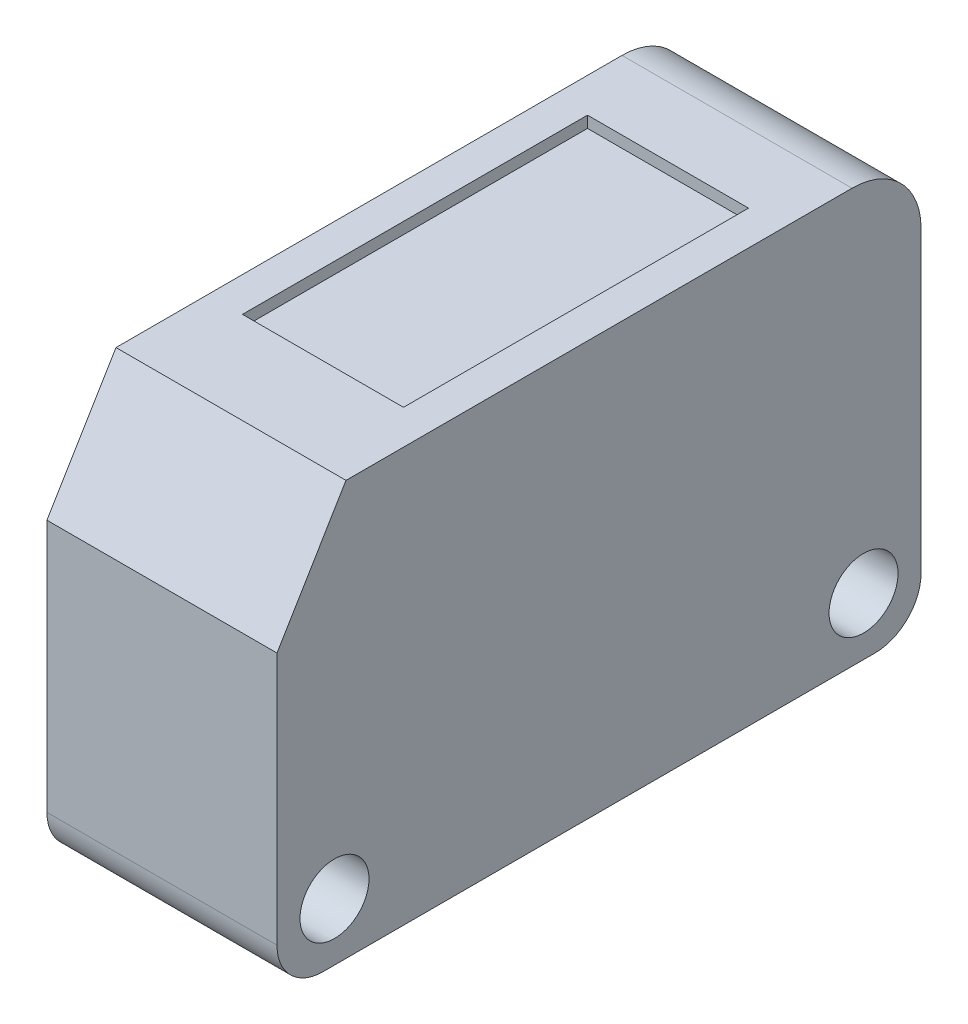
ISO-10303-21;
HEADER;
FILE_DESCRIPTION(('STEP AP214'),'2;1');
FILE_NAME('part.step','',(''),(''),'','','');
FILE_SCHEMA(('AUTOMOTIVE_DESIGN { 1 0 10303 214 1 1 1 1 }'));
ENDSEC;
DATA;
#1=APPLICATION_CONTEXT('core data for automotive mechanical design processes');
#2=APPLICATION_PROTOCOL_DEFINITION('international standard','automotive_design',2000,#1);
#3=PRODUCT_CONTEXT('',#1,'mechanical');
#4=PRODUCT('Part','Part','',(#3));
#5=PRODUCT_RELATED_PRODUCT_CATEGORY('part','',(#4));
#6=PRODUCT_DEFINITION_FORMATION('','',#4);
#7=PRODUCT_DEFINITION_CONTEXT('part definition',#1,'design');
#8=PRODUCT_DEFINITION('design','',#6,#7);
#9=PRODUCT_DEFINITION_SHAPE('','',#8);
#10=(LENGTH_UNIT() NAMED_UNIT(*) SI_UNIT(.MILLI.,.METRE.));
#11=(NAMED_UNIT(*) PLANE_ANGLE_UNIT() SI_UNIT($,.RADIAN.));
#12=(NAMED_UNIT(*) SI_UNIT($,.STERADIAN.) SOLID_ANGLE_UNIT());
#13=UNCERTAINTY_MEASURE_WITH_UNIT(LENGTH_MEASURE(1.E-05),#10,'distance_accuracy_value','');
#14=(GEOMETRIC_REPRESENTATION_CONTEXT(3) GLOBAL_UNCERTAINTY_ASSIGNED_CONTEXT((#13)) GLOBAL_UNIT_ASSIGNED_CONTEXT((#10,
#11,#12)) REPRESENTATION_CONTEXT('',''));
#15=CARTESIAN_POINT('',(0.,0.,0.));
#16=DIRECTION('',(0.,0.,1.));
#17=DIRECTION('',(1.,0.,0.));
#18=AXIS2_PLACEMENT_3D('',#15,#16,#17);
#19=CARTESIAN_POINT('',(5.,15.,3.));
#20=DIRECTION('',(1.,0.,0.));
#21=DIRECTION('',(0.,0.,-1.));
#22=AXIS2_PLACEMENT_3D('',#19,#20,#21);
#23=CYLINDRICAL_SURFACE('',#22,3.);
#24=CARTESIAN_POINT('',(10.,15.,3.));
#25=DIRECTION('',(1.,0.,0.));
#26=DIRECTION('',(0.,0.,-1.));
#27=AXIS2_PLACEMENT_3D('',#24,#25,#26);
#28=CIRCLE('',#27,3.);
#29=CARTESIAN_POINT('',(10.,15.,0.));
#30=VERTEX_POINT('',#29);
#31=CARTESIAN_POINT('',(10.,18.,3.));
#32=VERTEX_POINT('',#31);
#33=EDGE_CURVE('E10',#30,#32,#28,.T.);
#34=ORIENTED_EDGE('',*,*,#33,.F.);
#35=DIRECTION('',(1.,0.,0.));
#36=VECTOR('',#35,1.);
#37=CARTESIAN_POINT('',(5.,15.,0.));
#38=LINE('',#37,#36);
#39=CARTESIAN_POINT('',(0.,15.,0.));
#40=VERTEX_POINT('',#39);
#41=EDGE_CURVE('E26',#40,#30,#38,.T.);
#42=ORIENTED_EDGE('',*,*,#41,.F.);
#43=CARTESIAN_POINT('',(0.,15.,3.));
#44=DIRECTION('',(1.,0.,0.));
#45=DIRECTION('',(0.,0.,-1.));
#46=AXIS2_PLACEMENT_3D('',#43,#44,#45);
#47=CIRCLE('',#46,3.);
#48=CARTESIAN_POINT('',(0.,18.,3.));
#49=VERTEX_POINT('',#48);
#50=EDGE_CURVE('E146',#40,#49,#47,.T.);
#51=ORIENTED_EDGE('',*,*,#50,.T.);
#52=DIRECTION('',(1.,0.,0.));
#53=VECTOR('',#52,1.);
#54=CARTESIAN_POINT('',(5.,18.,3.));
#55=LINE('',#54,#53);
#56=EDGE_CURVE('E35',#49,#32,#55,.T.);
#57=ORIENTED_EDGE('',*,*,#56,.T.);
#58=EDGE_LOOP('',(#34,#42,#51,#57));
#59=FACE_BOUND('',#58,.T.);
#60=ADVANCED_FACE('F15',(#59),#23,.T.);
#61=CARTESIAN_POINT('',(0.,13.,28.));
#62=DIRECTION('',(0.,-0.514495755427526,-0.857492925712545));
#63=DIRECTION('',(0.,0.857492925712545,-0.514495755427526));
#64=AXIS2_PLACEMENT_3D('',#61,#62,#63);
#65=PLANE('',#64);
#66=DIRECTION('',(0.,-0.857492925712545,0.514495755427526));
#67=VECTOR('',#66,1.);
#68=CARTESIAN_POINT('',(10.,15.5,26.5));
#69=LINE('',#68,#67);
#70=CARTESIAN_POINT('',(10.,18.,25.));
#71=VERTEX_POINT('',#70);
#72=CARTESIAN_POINT('',(10.,13.,28.));
#73=VERTEX_POINT('',#72);
#74=EDGE_CURVE('E235',#71,#73,#69,.T.);
#75=ORIENTED_EDGE('',*,*,#74,.F.);
#76=DIRECTION('',(1.,0.,0.));
#77=VECTOR('',#76,1.);
#78=CARTESIAN_POINT('',(5.,18.,25.));
#79=LINE('',#78,#77);
#80=CARTESIAN_POINT('',(0.,18.,25.));
#81=VERTEX_POINT('',#80);
#82=EDGE_CURVE('E232',#81,#71,#79,.T.);
#83=ORIENTED_EDGE('',*,*,#82,.F.);
#84=DIRECTION('',(0.,-0.857492925712545,0.514495755427526));
#85=VECTOR('',#84,1.);
#86=CARTESIAN_POINT('',(0.,15.5,26.5));
#87=LINE('',#86,#85);
#88=CARTESIAN_POINT('',(0.,13.,28.));
#89=VERTEX_POINT('',#88);
#90=EDGE_CURVE('E164',#81,#89,#87,.T.);
#91=ORIENTED_EDGE('',*,*,#90,.T.);
#92=DIRECTION('',(1.,0.,0.));
#93=VECTOR('',#92,1.);
#94=CARTESIAN_POINT('',(5.,13.,28.));
#95=LINE('',#94,#93);
#96=EDGE_CURVE('E161',#89,#73,#95,.T.);
#97=ORIENTED_EDGE('',*,*,#96,.T.);
#98=EDGE_LOOP('',(#75,#83,#91,#97));
#99=FACE_BOUND('',#98,.T.);
#100=ADVANCED_FACE('F270',(#99),#65,.F.);
#101=CARTESIAN_POINT('',(0.,18.,3.));
#102=DIRECTION('',(0.,1.,0.));
#103=DIRECTION('',(0.,0.,1.));
#104=AXIS2_PLACEMENT_3D('',#101,#102,#103);
#105=PLANE('',#104);
#106=DIRECTION('',(0.,0.,1.));
#107=VECTOR('',#106,1.);
#108=CARTESIAN_POINT('',(10.,18.,14.));
#109=LINE('',#108,#107);
#110=EDGE_CURVE('E228',#32,#71,#109,.T.);
#111=ORIENTED_EDGE('',*,*,#110,.F.);
#112=ORIENTED_EDGE('',*,*,#56,.F.);
#113=DIRECTION('',(0.,0.,1.));
#114=VECTOR('',#113,1.);
#115=CARTESIAN_POINT('',(0.,18.,14.));
#116=LINE('',#115,#114);
#117=EDGE_CURVE('E224',#49,#81,#116,.T.);
#118=ORIENTED_EDGE('',*,*,#117,.T.);
#119=ORIENTED_EDGE('',*,*,#82,.T.);
#120=EDGE_LOOP('',(#111,#112,#118,#119));
#121=FACE_BOUND('',#120,.T.);
#122=DIRECTION('',(1.,0.,0.));
#123=VECTOR('',#122,1.);
#124=CARTESIAN_POINT('',(5.,18.,21.));
#125=LINE('',#124,#123);
#126=CARTESIAN_POINT('',(1.5,18.,21.));
#127=VERTEX_POINT('',#126);
#128=CARTESIAN_POINT('',(8.5,18.,21.));
#129=VERTEX_POINT('',#128);
#130=EDGE_CURVE('E220',#127,#129,#125,.T.);
#131=ORIENTED_EDGE('',*,*,#130,.F.);
#132=DIRECTION('',(0.,0.,1.));
#133=VECTOR('',#132,1.);
#134=CARTESIAN_POINT('',(1.5,18.,13.5));
#135=LINE('',#134,#133);
#136=CARTESIAN_POINT('',(1.5,18.,6.));
#137=VERTEX_POINT('',#136);
#138=EDGE_CURVE('E209',#137,#127,#135,.T.);
#139=ORIENTED_EDGE('',*,*,#138,.F.);
#140=DIRECTION('',(-1.,0.,0.));
#141=VECTOR('',#140,1.);
#142=CARTESIAN_POINT('',(5.,18.,6.));
#143=LINE('',#142,#141);
#144=CARTESIAN_POINT('',(8.5,18.,6.));
#145=VERTEX_POINT('',#144);
#146=EDGE_CURVE('E212',#145,#137,#143,.T.);
#147=ORIENTED_EDGE('',*,*,#146,.F.);
#148=DIRECTION('',(0.,0.,-1.));
#149=VECTOR('',#148,1.);
#150=CARTESIAN_POINT('',(8.5,18.,13.5));
#151=LINE('',#150,#149);
#152=EDGE_CURVE('E216',#129,#145,#151,.T.);
#153=ORIENTED_EDGE('',*,*,#152,.F.);
#154=EDGE_LOOP('',(#131,#139,#147,#153));
#155=FACE_BOUND('',#154,.T.);
#156=ADVANCED_FACE('F265',(#121,#155),#105,.T.);
#157=CARTESIAN_POINT('',(8.5,18.,21.));
#158=DIRECTION('',(-1.,0.,0.));
#159=DIRECTION('',(0.,0.,1.));
#160=AXIS2_PLACEMENT_3D('',#157,#158,#159);
#161=PLANE('',#160);
#162=DIRECTION('',(0.,0.,-1.));
#163=VECTOR('',#162,1.);
#164=CARTESIAN_POINT('',(8.5,17.5,13.5));
#165=LINE('',#164,#163);
#166=CARTESIAN_POINT('',(8.5,17.5,21.));
#167=VERTEX_POINT('',#166);
#168=CARTESIAN_POINT('',(8.5,17.5,5.99999999999999));
#169=VERTEX_POINT('',#168);
#170=EDGE_CURVE('E203',#167,#169,#165,.T.);
#171=ORIENTED_EDGE('',*,*,#170,.F.);
#172=DIRECTION('',(0.,-1.,0.));
#173=VECTOR('',#172,1.);
#174=CARTESIAN_POINT('',(8.5,17.75,21.));
#175=LINE('',#174,#173);
#176=EDGE_CURVE('E200',#129,#167,#175,.T.);
#177=ORIENTED_EDGE('',*,*,#176,.F.);
#178=ORIENTED_EDGE('',*,*,#152,.T.);
#179=DIRECTION('',(0.,-1.,0.));
#180=VECTOR('',#179,1.);
#181=CARTESIAN_POINT('',(8.5,17.75,5.99999999999999));
#182=LINE('',#181,#180);
#183=EDGE_CURVE('E186',#145,#169,#182,.T.);
#184=ORIENTED_EDGE('',*,*,#183,.T.);
#185=EDGE_LOOP('',(#171,#177,#178,#184));
#186=FACE_BOUND('',#185,.T.);
#187=ADVANCED_FACE('F298',(#186),#161,.T.);
#188=CARTESIAN_POINT('',(8.5,18.,21.));
#189=DIRECTION('',(0.,0.,1.));
#190=DIRECTION('',(1.,0.,0.));
#191=AXIS2_PLACEMENT_3D('',#188,#189,#190);
#192=PLANE('',#191);
#193=DIRECTION('',(1.,0.,0.));
#194=VECTOR('',#193,1.);
#195=CARTESIAN_POINT('',(5.,17.5,21.));
#196=LINE('',#195,#194);
#197=CARTESIAN_POINT('',(1.5,17.5,21.));
#198=VERTEX_POINT('',#197);
#199=EDGE_CURVE('E196',#198,#167,#196,.T.);
#200=ORIENTED_EDGE('',*,*,#199,.F.);
#201=DIRECTION('',(0.,-1.,0.));
#202=VECTOR('',#201,1.);
#203=CARTESIAN_POINT('',(1.5,17.75,21.));
#204=LINE('',#203,#202);
#205=EDGE_CURVE('E193',#127,#198,#204,.T.);
#206=ORIENTED_EDGE('',*,*,#205,.F.);
#207=ORIENTED_EDGE('',*,*,#130,.T.);
#208=ORIENTED_EDGE('',*,*,#176,.T.);
#209=EDGE_LOOP('',(#200,#206,#207,#208));
#210=FACE_BOUND('',#209,.T.);
#211=ADVANCED_FACE('F301',(#210),#192,.F.);
#212=CARTESIAN_POINT('',(1.5,18.,6.));
#213=DIRECTION('',(0.,0.,-1.));
#214=DIRECTION('',(-1.,0.,0.));
#215=AXIS2_PLACEMENT_3D('',#212,#213,#214);
#216=PLANE('',#215);
#217=DIRECTION('',(-1.,0.,0.));
#218=VECTOR('',#217,1.);
#219=CARTESIAN_POINT('',(5.,17.5,6.));
#220=LINE('',#219,#218);
#221=CARTESIAN_POINT('',(1.5,17.5,6.));
#222=VERTEX_POINT('',#221);
#223=EDGE_CURVE('E189',#169,#222,#220,.T.);
#224=ORIENTED_EDGE('',*,*,#223,.F.);
#225=ORIENTED_EDGE('',*,*,#183,.F.);
#226=ORIENTED_EDGE('',*,*,#146,.T.);
#227=DIRECTION('',(0.,-1.,0.));
#228=VECTOR('',#227,1.);
#229=CARTESIAN_POINT('',(1.5,17.75,6.));
#230=LINE('',#229,#228);
#231=EDGE_CURVE('E181',#137,#222,#230,.T.);
#232=ORIENTED_EDGE('',*,*,#231,.T.);
#233=EDGE_LOOP('',(#224,#225,#226,#232));
#234=FACE_BOUND('',#233,.T.);
#235=ADVANCED_FACE('F305',(#234),#216,.F.);
#236=CARTESIAN_POINT('',(0.,17.5,0.));
#237=DIRECTION('',(0.,1.,0.));
#238=DIRECTION('',(0.,0.,1.));
#239=AXIS2_PLACEMENT_3D('',#236,#237,#238);
#240=PLANE('',#239);
#241=ORIENTED_EDGE('',*,*,#199,.T.);
#242=ORIENTED_EDGE('',*,*,#170,.T.);
#243=ORIENTED_EDGE('',*,*,#223,.T.);
#244=DIRECTION('',(0.,0.,1.));
#245=VECTOR('',#244,1.);
#246=CARTESIAN_POINT('',(1.5,17.5,13.5));
#247=LINE('',#246,#245);
#248=EDGE_CURVE('E182',#222,#198,#247,.T.);
#249=ORIENTED_EDGE('',*,*,#248,.T.);
#250=EDGE_LOOP('',(#241,#242,#243,#249));
#251=FACE_BOUND('',#250,.T.);
#252=ADVANCED_FACE('F309',(#251),#240,.T.);
#253=CARTESIAN_POINT('',(1.5,18.,6.));
#254=DIRECTION('',(1.,0.,0.));
#255=DIRECTION('',(0.,0.,-1.));
#256=AXIS2_PLACEMENT_3D('',#253,#254,#255);
#257=PLANE('',#256);
#258=ORIENTED_EDGE('',*,*,#248,.F.);
#259=ORIENTED_EDGE('',*,*,#231,.F.);
#260=ORIENTED_EDGE('',*,*,#138,.T.);
#261=ORIENTED_EDGE('',*,*,#205,.T.);
#262=EDGE_LOOP('',(#258,#259,#260,#261));
#263=FACE_BOUND('',#262,.T.);
#264=ADVANCED_FACE('F313',(#263),#257,.T.);
#265=CARTESIAN_POINT('',(5.,2.5,2.5));
#266=DIRECTION('',(1.,0.,0.));
#267=DIRECTION('',(0.,0.,-1.));
#268=AXIS2_PLACEMENT_3D('',#265,#266,#267);
#269=CYLINDRICAL_SURFACE('',#268,1.5);
#270=CARTESIAN_POINT('',(0.,2.5,2.5));
#271=DIRECTION('',(1.,0.,0.));
#272=DIRECTION('',(0.,0.,-1.));
#273=AXIS2_PLACEMENT_3D('',#270,#271,#272);
#274=CIRCLE('',#273,1.5);
#275=CARTESIAN_POINT('',(0.,2.5,1.));
#276=VERTEX_POINT('',#275);
#277=EDGE_CURVE('E174',#276,#276,#274,.T.);
#278=ORIENTED_EDGE('',*,*,#277,.F.);
#279=EDGE_LOOP('',(#278));
#280=FACE_BOUND('',#279,.T.);
#281=CARTESIAN_POINT('',(10.,2.5,2.5));
#282=DIRECTION('',(1.,0.,0.));
#283=DIRECTION('',(0.,0.,-1.));
#284=AXIS2_PLACEMENT_3D('',#281,#282,#283);
#285=CIRCLE('',#284,1.5);
#286=CARTESIAN_POINT('',(10.,2.5,1.));
#287=VERTEX_POINT('',#286);
#288=EDGE_CURVE('E145',#287,#287,#285,.T.);
#289=ORIENTED_EDGE('',*,*,#288,.T.);
#290=EDGE_LOOP('',(#289));
#291=FACE_BOUND('',#290,.T.);
#292=ADVANCED_FACE('F317',(#280,#291),#269,.F.);
#293=CARTESIAN_POINT('',(5.,2.5,25.5));
#294=DIRECTION('',(1.,0.,0.));
#295=DIRECTION('',(0.,0.,-1.));
#296=AXIS2_PLACEMENT_3D('',#293,#294,#295);
#297=CYLINDRICAL_SURFACE('',#296,1.5);
#298=CARTESIAN_POINT('',(0.,2.5,25.5));
#299=DIRECTION('',(1.,0.,0.));
#300=DIRECTION('',(0.,0.,-1.));
#301=AXIS2_PLACEMENT_3D('',#298,#299,#300);
#302=CIRCLE('',#301,1.5);
#303=CARTESIAN_POINT('',(0.,2.5,24.));
#304=VERTEX_POINT('',#303);
#305=EDGE_CURVE('E170',#304,#304,#302,.T.);
#306=ORIENTED_EDGE('',*,*,#305,.F.);
#307=EDGE_LOOP('',(#306));
#308=FACE_BOUND('',#307,.T.);
#309=CARTESIAN_POINT('',(10.,2.5,25.5));
#310=DIRECTION('',(1.,0.,0.));
#311=DIRECTION('',(0.,0.,-1.));
#312=AXIS2_PLACEMENT_3D('',#309,#310,#311);
#313=CIRCLE('',#312,1.5);
#314=CARTESIAN_POINT('',(10.,2.5,24.));
#315=VERTEX_POINT('',#314);
#316=EDGE_CURVE('E135',#315,#315,#313,.T.);
#317=ORIENTED_EDGE('',*,*,#316,.T.);
#318=EDGE_LOOP('',(#317));
#319=FACE_BOUND('',#318,.T.);
#320=ADVANCED_FACE('F287',(#308,#319),#297,.F.);
#321=CARTESIAN_POINT('',(0.,13.,28.));
#322=DIRECTION('',(0.,0.,1.));
#323=DIRECTION('',(1.,0.,0.));
#324=AXIS2_PLACEMENT_3D('',#321,#322,#323);
#325=PLANE('',#324);
#326=DIRECTION('',(1.,0.,0.));
#327=VECTOR('',#326,1.);
#328=CARTESIAN_POINT('',(5.,2.,28.));
#329=LINE('',#328,#327);
#330=CARTESIAN_POINT('',(0.,2.,28.));
#331=VERTEX_POINT('',#330);
#332=CARTESIAN_POINT('',(10.,2.,28.));
#333=VERTEX_POINT('',#332);
#334=EDGE_CURVE('E151',#331,#333,#329,.T.);
#335=ORIENTED_EDGE('',*,*,#334,.T.);
#336=DIRECTION('',(0.,-1.,0.));
#337=VECTOR('',#336,1.);
#338=CARTESIAN_POINT('',(10.,7.5,28.));
#339=LINE('',#338,#337);
#340=EDGE_CURVE('E158',#73,#333,#339,.T.);
#341=ORIENTED_EDGE('',*,*,#340,.F.);
#342=ORIENTED_EDGE('',*,*,#96,.F.);
#343=DIRECTION('',(0.,-1.,0.));
#344=VECTOR('',#343,1.);
#345=CARTESIAN_POINT('',(0.,7.5,28.));
#346=LINE('',#345,#344);
#347=EDGE_CURVE('E155',#89,#331,#346,.T.);
#348=ORIENTED_EDGE('',*,*,#347,.T.);
#349=EDGE_LOOP('',(#335,#341,#342,#348));
#350=FACE_BOUND('',#349,.T.);
#351=ADVANCED_FACE('F274',(#350),#325,.T.);
#352=CARTESIAN_POINT('',(5.,2.,26.));
#353=DIRECTION('',(1.,0.,0.));
#354=DIRECTION('',(0.,0.,-1.));
#355=AXIS2_PLACEMENT_3D('',#352,#353,#354);
#356=CYLINDRICAL_SURFACE('',#355,2.);
#357=DIRECTION('',(1.,0.,0.));
#358=VECTOR('',#357,1.);
#359=CARTESIAN_POINT('',(5.,0.,26.));
#360=LINE('',#359,#358);
#361=CARTESIAN_POINT('',(0.,0.,26.));
#362=VERTEX_POINT('',#361);
#363=CARTESIAN_POINT('',(10.,0.,26.));
#364=VERTEX_POINT('',#363);
#365=EDGE_CURVE('E126',#362,#364,#360,.T.);
#366=ORIENTED_EDGE('',*,*,#365,.T.);
#367=CARTESIAN_POINT('',(10.,2.,26.));
#368=DIRECTION('',(-1.,0.,0.));
#369=DIRECTION('',(0.,0.,-1.));
#370=AXIS2_PLACEMENT_3D('',#367,#368,#369);
#371=CIRCLE('',#370,2.);
#372=EDGE_CURVE('E123',#364,#333,#371,.T.);
#373=ORIENTED_EDGE('',*,*,#372,.T.);
#374=ORIENTED_EDGE('',*,*,#334,.F.);
#375=CARTESIAN_POINT('',(0.,2.,26.));
#376=DIRECTION('',(1.,0.,0.));
#377=DIRECTION('',(0.,0.,-1.));
#378=AXIS2_PLACEMENT_3D('',#375,#376,#377);
#379=CIRCLE('',#378,2.);
#380=EDGE_CURVE('E139',#331,#362,#379,.T.);
#381=ORIENTED_EDGE('',*,*,#380,.T.);
#382=EDGE_LOOP('',(#366,#373,#374,#381));
#383=FACE_BOUND('',#382,.T.);
#384=ADVANCED_FACE('F278',(#383),#356,.T.);
#385=CARTESIAN_POINT('',(0.,0.,0.));
#386=DIRECTION('',(0.,0.,-1.));
#387=DIRECTION('',(-1.,0.,0.));
#388=AXIS2_PLACEMENT_3D('',#385,#386,#387);
#389=PLANE('',#388);
#390=DIRECTION('',(1.,0.,0.));
#391=VECTOR('',#390,1.);
#392=CARTESIAN_POINT('',(5.,2.,0.));
#393=LINE('',#392,#391);
#394=CARTESIAN_POINT('',(0.,2.,0.));
#395=VERTEX_POINT('',#394);
#396=CARTESIAN_POINT('',(10.,2.,0.));
#397=VERTEX_POINT('',#396);
#398=EDGE_CURVE('E130',#395,#397,#393,.T.);
#399=ORIENTED_EDGE('',*,*,#398,.F.);
#400=DIRECTION('',(0.,1.,0.));
#401=VECTOR('',#400,1.);
#402=CARTESIAN_POINT('',(0.,8.5,0.));
#403=LINE('',#402,#401);
#404=EDGE_CURVE('E141',#395,#40,#403,.T.);
#405=ORIENTED_EDGE('',*,*,#404,.T.);
#406=ORIENTED_EDGE('',*,*,#41,.T.);
#407=DIRECTION('',(0.,1.,0.));
#408=VECTOR('',#407,1.);
#409=CARTESIAN_POINT('',(10.,8.5,0.));
#410=LINE('',#409,#408);
#411=EDGE_CURVE('E147',#397,#30,#410,.T.);
#412=ORIENTED_EDGE('',*,*,#411,.F.);
#413=EDGE_LOOP('',(#399,#405,#406,#412));
#414=FACE_BOUND('',#413,.T.);
#415=ADVANCED_FACE('F262',(#414),#389,.T.);
#416=CARTESIAN_POINT('',(0.,0.,28.));
#417=DIRECTION('',(0.,-1.,0.));
#418=DIRECTION('',(0.,0.,-1.));
#419=AXIS2_PLACEMENT_3D('',#416,#417,#418);
#420=PLANE('',#419);
#421=DIRECTION('',(1.,0.,0.));
#422=VECTOR('',#421,1.);
#423=CARTESIAN_POINT('',(5.,0.,2.));
#424=LINE('',#423,#422);
#425=CARTESIAN_POINT('',(0.,0.,2.));
#426=VERTEX_POINT('',#425);
#427=CARTESIAN_POINT('',(10.,0.,2.));
#428=VERTEX_POINT('',#427);
#429=EDGE_CURVE('E102',#426,#428,#424,.T.);
#430=ORIENTED_EDGE('',*,*,#429,.T.);
#431=DIRECTION('',(0.,0.,-1.));
#432=VECTOR('',#431,1.);
#433=CARTESIAN_POINT('',(10.,0.,14.));
#434=LINE('',#433,#432);
#435=EDGE_CURVE('E109',#364,#428,#434,.T.);
#436=ORIENTED_EDGE('',*,*,#435,.F.);
#437=ORIENTED_EDGE('',*,*,#365,.F.);
#438=DIRECTION('',(0.,0.,-1.));
#439=VECTOR('',#438,1.);
#440=CARTESIAN_POINT('',(0.,0.,14.));
#441=LINE('',#440,#439);
#442=EDGE_CURVE('E111',#362,#426,#441,.T.);
#443=ORIENTED_EDGE('',*,*,#442,.T.);
#444=EDGE_LOOP('',(#430,#436,#437,#443));
#445=FACE_BOUND('',#444,.T.);
#446=ADVANCED_FACE('F107',(#445),#420,.T.);
#447=CARTESIAN_POINT('',(10.,0.,0.));
#448=DIRECTION('',(1.,0.,0.));
#449=DIRECTION('',(0.,0.,-1.));
#450=AXIS2_PLACEMENT_3D('',#447,#448,#449);
#451=PLANE('',#450);
#452=CARTESIAN_POINT('',(10.,2.,2.));
#453=DIRECTION('',(-1.,0.,0.));
#454=DIRECTION('',(0.,0.,-1.));
#455=AXIS2_PLACEMENT_3D('',#452,#453,#454);
#456=CIRCLE('',#455,2.);
#457=EDGE_CURVE('E120',#397,#428,#456,.T.);
#458=ORIENTED_EDGE('',*,*,#457,.F.);
#459=ORIENTED_EDGE('',*,*,#411,.T.);
#460=ORIENTED_EDGE('',*,*,#33,.T.);
#461=ORIENTED_EDGE('',*,*,#110,.T.);
#462=ORIENTED_EDGE('',*,*,#74,.T.);
#463=ORIENTED_EDGE('',*,*,#340,.T.);
#464=ORIENTED_EDGE('',*,*,#372,.F.);
#465=ORIENTED_EDGE('',*,*,#435,.T.);
#466=EDGE_LOOP('',(#458,#459,#460,#461,#462,#463,#464,#465));
#467=FACE_BOUND('',#466,.T.);
#468=ORIENTED_EDGE('',*,*,#316,.F.);
#469=EDGE_LOOP('',(#468));
#470=FACE_BOUND('',#469,.T.);
#471=ORIENTED_EDGE('',*,*,#288,.F.);
#472=EDGE_LOOP('',(#471));
#473=FACE_BOUND('',#472,.T.);
#474=ADVANCED_FACE('F117',(#467,#470,#473),#451,.T.);
#475=CARTESIAN_POINT('',(0.,0.,0.));
#476=DIRECTION('',(1.,0.,0.));
#477=DIRECTION('',(0.,0.,-1.));
#478=AXIS2_PLACEMENT_3D('',#475,#476,#477);
#479=PLANE('',#478);
#480=ORIENTED_EDGE('',*,*,#404,.F.);
#481=CARTESIAN_POINT('',(0.,2.,2.));
#482=DIRECTION('',(1.,0.,0.));
#483=DIRECTION('',(0.,0.,-1.));
#484=AXIS2_PLACEMENT_3D('',#481,#482,#483);
#485=CIRCLE('',#484,2.);
#486=EDGE_CURVE('E19',#426,#395,#485,.T.);
#487=ORIENTED_EDGE('',*,*,#486,.F.);
#488=ORIENTED_EDGE('',*,*,#442,.F.);
#489=ORIENTED_EDGE('',*,*,#380,.F.);
#490=ORIENTED_EDGE('',*,*,#347,.F.);
#491=ORIENTED_EDGE('',*,*,#90,.F.);
#492=ORIENTED_EDGE('',*,*,#117,.F.);
#493=ORIENTED_EDGE('',*,*,#50,.F.);
#494=EDGE_LOOP('',(#480,#487,#488,#489,#490,#491,#492,#493));
#495=FACE_BOUND('',#494,.T.);
#496=ORIENTED_EDGE('',*,*,#305,.T.);
#497=EDGE_LOOP('',(#496));
#498=FACE_BOUND('',#497,.T.);
#499=ORIENTED_EDGE('',*,*,#277,.T.);
#500=EDGE_LOOP('',(#499));
#501=FACE_BOUND('',#500,.T.);
#502=ADVANCED_FACE('F256',(#495,#498,#501),#479,.F.);
#503=CARTESIAN_POINT('',(5.,2.,2.));
#504=DIRECTION('',(1.,0.,0.));
#505=DIRECTION('',(0.,0.,-1.));
#506=AXIS2_PLACEMENT_3D('',#503,#504,#505);
#507=CYLINDRICAL_SURFACE('',#506,2.);
#508=ORIENTED_EDGE('',*,*,#398,.T.);
#509=ORIENTED_EDGE('',*,*,#457,.T.);
#510=ORIENTED_EDGE('',*,*,#429,.F.);
#511=ORIENTED_EDGE('',*,*,#486,.T.);
#512=EDGE_LOOP('',(#508,#509,#510,#511));
#513=FACE_BOUND('',#512,.T.);
#514=ADVANCED_FACE('F17',(#513),#507,.T.);
#515=CLOSED_SHELL('',(#60,#100,#156,#187,#211,#235,#252,#264,#292,#320,#351,#384,#415,#446,#474,
#502,#514));
#516=MANIFOLD_SOLID_BREP('B1',#515);
#517=ADVANCED_BREP_SHAPE_REPRESENTATION('',(#18,#516),#14);
#518=SHAPE_DEFINITION_REPRESENTATION(#9,#517);
ENDSEC;
END-ISO-10303-21;
